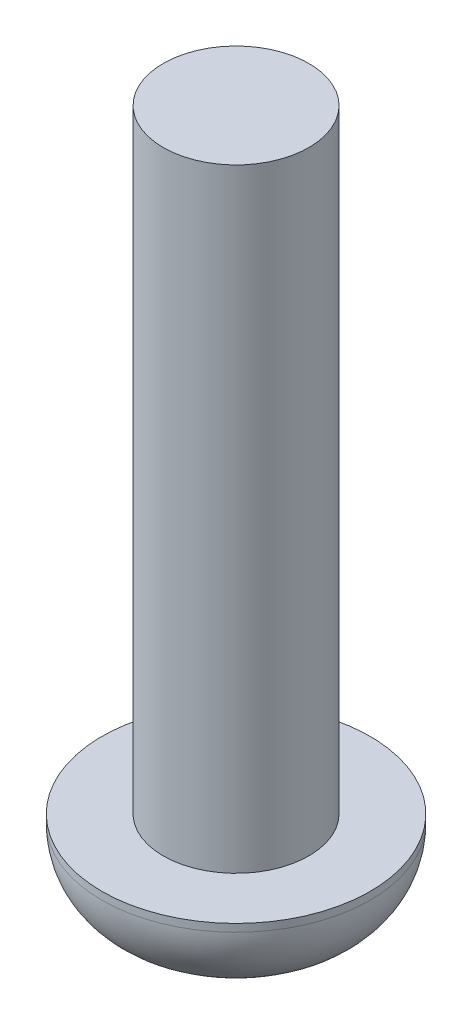
ISO-10303-21;
HEADER;
FILE_DESCRIPTION(('STEP AP214'),'2;1');
FILE_NAME('part.step','',(''),(''),'','','');
FILE_SCHEMA(('AUTOMOTIVE_DESIGN { 1 0 10303 214 1 1 1 1 }'));
ENDSEC;
DATA;
#1=APPLICATION_CONTEXT('core data for automotive mechanical design processes');
#2=APPLICATION_PROTOCOL_DEFINITION('international standard','automotive_design',2000,#1);
#3=PRODUCT_CONTEXT('',#1,'mechanical');
#4=PRODUCT('Part','Part','',(#3));
#5=PRODUCT_RELATED_PRODUCT_CATEGORY('part','',(#4));
#6=PRODUCT_DEFINITION_FORMATION('','',#4);
#7=PRODUCT_DEFINITION_CONTEXT('part definition',#1,'design');
#8=PRODUCT_DEFINITION('design','',#6,#7);
#9=PRODUCT_DEFINITION_SHAPE('','',#8);
#10=(LENGTH_UNIT() NAMED_UNIT(*) SI_UNIT(.MILLI.,.METRE.));
#11=(NAMED_UNIT(*) PLANE_ANGLE_UNIT() SI_UNIT($,.RADIAN.));
#12=(NAMED_UNIT(*) SI_UNIT($,.STERADIAN.) SOLID_ANGLE_UNIT());
#13=UNCERTAINTY_MEASURE_WITH_UNIT(LENGTH_MEASURE(1.E-05),#10,'distance_accuracy_value','');
#14=(GEOMETRIC_REPRESENTATION_CONTEXT(3) GLOBAL_UNCERTAINTY_ASSIGNED_CONTEXT((#13)) GLOBAL_UNIT_ASSIGNED_CONTEXT((#10,
#11,#12)) REPRESENTATION_CONTEXT('',''));
#15=CARTESIAN_POINT('',(0.,0.,0.));
#16=DIRECTION('',(0.,0.,1.));
#17=DIRECTION('',(1.,0.,0.));
#18=AXIS2_PLACEMENT_3D('',#15,#16,#17);
#19=CARTESIAN_POINT('',(0.,2.2,0.));
#20=DIRECTION('',(0.,-1.,0.));
#21=DIRECTION('',(0.,0.,-1.));
#22=AXIS2_PLACEMENT_3D('',#19,#20,#21);
#23=CYLINDRICAL_SURFACE('',#22,3.5);
#24=CARTESIAN_POINT('',(0.,2.,0.));
#25=DIRECTION('',(0.,1.,0.));
#26=DIRECTION('',(0.,0.,1.));
#27=AXIS2_PLACEMENT_3D('',#24,#25,#26);
#28=CIRCLE('',#27,3.5);
#29=CARTESIAN_POINT('',(0.,2.,3.5));
#30=VERTEX_POINT('',#29);
#31=EDGE_CURVE('E44',#30,#30,#28,.T.);
#32=ORIENTED_EDGE('',*,*,#31,.T.);
#33=EDGE_LOOP('',(#32));
#34=FACE_BOUND('',#33,.T.);
#35=CARTESIAN_POINT('',(0.,2.2,0.));
#36=DIRECTION('',(0.,1.,0.));
#37=DIRECTION('',(0.,0.,1.));
#38=AXIS2_PLACEMENT_3D('',#35,#36,#37);
#39=CIRCLE('',#38,3.5);
#40=CARTESIAN_POINT('',(0.,2.2,3.5));
#41=VERTEX_POINT('',#40);
#42=EDGE_CURVE('E52',#41,#41,#39,.T.);
#43=ORIENTED_EDGE('',*,*,#42,.F.);
#44=EDGE_LOOP('',(#43));
#45=FACE_BOUND('',#44,.T.);
#46=ADVANCED_FACE('F37',(#34,#45),#23,.T.);
#47=CARTESIAN_POINT('',(0.,2.2,0.));
#48=DIRECTION('',(0.,1.,0.));
#49=DIRECTION('',(0.,0.,1.));
#50=AXIS2_PLACEMENT_3D('',#47,#48,#49);
#51=PLANE('',#50);
#52=CARTESIAN_POINT('',(0.,2.2,0.));
#53=DIRECTION('',(0.,1.,0.));
#54=DIRECTION('',(0.,0.,1.));
#55=AXIS2_PLACEMENT_3D('',#52,#53,#54);
#56=CIRCLE('',#55,1.9);
#57=CARTESIAN_POINT('',(0.,2.2,1.9));
#58=VERTEX_POINT('',#57);
#59=EDGE_CURVE('E48',#58,#58,#56,.T.);
#60=ORIENTED_EDGE('',*,*,#59,.F.);
#61=EDGE_LOOP('',(#60));
#62=FACE_BOUND('',#61,.T.);
#63=ORIENTED_EDGE('',*,*,#42,.T.);
#64=EDGE_LOOP('',(#63));
#65=FACE_BOUND('',#64,.T.);
#66=ADVANCED_FACE('F70',(#62,#65),#51,.T.);
#67=CARTESIAN_POINT('',(0.,0.,0.));
#68=DIRECTION('',(0.,1.,0.));
#69=DIRECTION('',(0.,0.,1.));
#70=AXIS2_PLACEMENT_3D('',#67,#68,#69);
#71=PLANE('',#70);
#72=CARTESIAN_POINT('',(0.,0.,0.));
#73=DIRECTION('',(0.,1.,0.));
#74=DIRECTION('',(0.,0.,1.));
#75=AXIS2_PLACEMENT_3D('',#72,#73,#74);
#76=CIRCLE('',#75,1.5);
#77=CARTESIAN_POINT('',(0.,0.,1.5));
#78=VERTEX_POINT('',#77);
#79=EDGE_CURVE('E10',#78,#78,#76,.F.);
#80=ORIENTED_EDGE('',*,*,#79,.T.);
#81=EDGE_LOOP('',(#80));
#82=FACE_BOUND('',#81,.T.);
#83=ADVANCED_FACE('F66',(#82),#71,.F.);
#84=CARTESIAN_POINT('',(0.,18.2,0.));
#85=DIRECTION('',(0.,-1.,0.));
#86=DIRECTION('',(0.,0.,-1.));
#87=AXIS2_PLACEMENT_3D('',#84,#85,#86);
#88=CYLINDRICAL_SURFACE('',#87,1.9);
#89=CARTESIAN_POINT('',(0.,18.2,0.));
#90=DIRECTION('',(0.,1.,0.));
#91=DIRECTION('',(0.,0.,1.));
#92=AXIS2_PLACEMENT_3D('',#89,#90,#91);
#93=CIRCLE('',#92,1.9);
#94=CARTESIAN_POINT('',(0.,18.2,1.9));
#95=VERTEX_POINT('',#94);
#96=EDGE_CURVE('E56',#95,#95,#93,.T.);
#97=ORIENTED_EDGE('',*,*,#96,.F.);
#98=EDGE_LOOP('',(#97));
#99=FACE_BOUND('',#98,.T.);
#100=ORIENTED_EDGE('',*,*,#59,.T.);
#101=EDGE_LOOP('',(#100));
#102=FACE_BOUND('',#101,.T.);
#103=ADVANCED_FACE('F63',(#99,#102),#88,.T.);
#104=CARTESIAN_POINT('',(0.,18.2,0.));
#105=DIRECTION('',(0.,1.,0.));
#106=DIRECTION('',(0.,0.,1.));
#107=AXIS2_PLACEMENT_3D('',#104,#105,#106);
#108=PLANE('',#107);
#109=ORIENTED_EDGE('',*,*,#96,.T.);
#110=EDGE_LOOP('',(#109));
#111=FACE_BOUND('',#110,.T.);
#112=ADVANCED_FACE('F61',(#111),#108,.T.);
#113=CARTESIAN_POINT('',(0.,2.,0.));
#114=DIRECTION('',(0.,1.,0.));
#115=DIRECTION('',(0.,0.,1.));
#116=AXIS2_PLACEMENT_3D('',#113,#114,#115);
#117=DEGENERATE_TOROIDAL_SURFACE('',#116,1.5,2.,.T.);
#118=ORIENTED_EDGE('',*,*,#79,.F.);
#119=EDGE_LOOP('',(#118));
#120=FACE_BOUND('',#119,.T.);
#121=ORIENTED_EDGE('',*,*,#31,.F.);
#122=EDGE_LOOP('',(#121));
#123=FACE_BOUND('',#122,.T.);
#124=ADVANCED_FACE('F39',(#120,#123),#117,.T.);
#125=CLOSED_SHELL('',(#46,#66,#83,#103,#112,#124));
#126=MANIFOLD_SOLID_BREP('B2',#125);
#127=ADVANCED_BREP_SHAPE_REPRESENTATION('',(#18,#126),#14);
#128=SHAPE_DEFINITION_REPRESENTATION(#9,#127);
ENDSEC;
END-ISO-10303-21;
